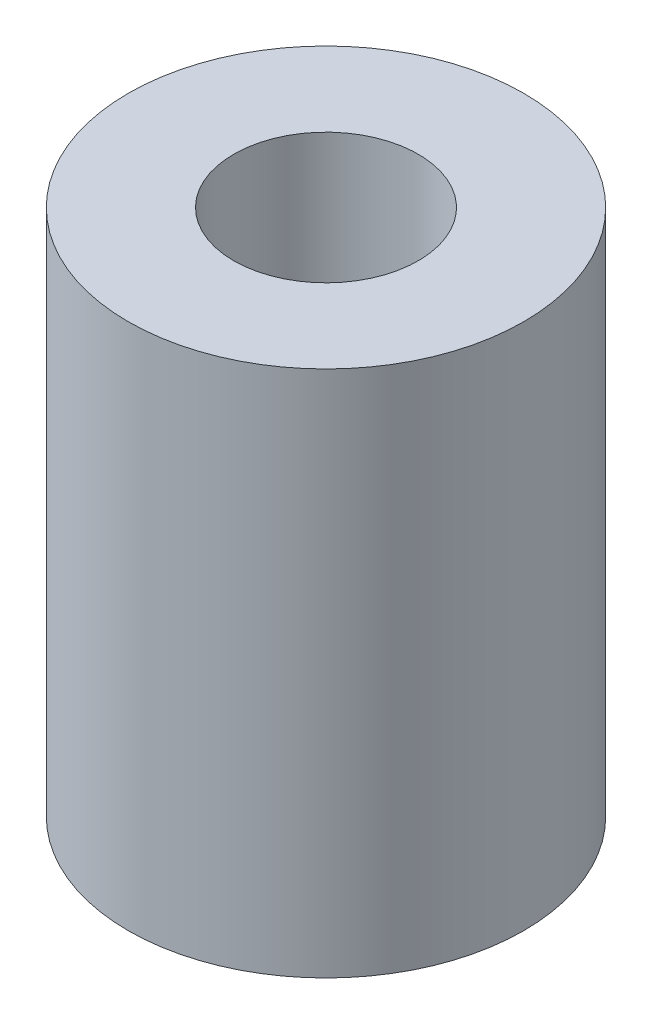
ISO-10303-21;
HEADER;
FILE_DESCRIPTION(('STEP AP214'),'2;1');
FILE_NAME('part.step','',(''),(''),'','','');
FILE_SCHEMA(('AUTOMOTIVE_DESIGN { 1 0 10303 214 1 1 1 1 }'));
ENDSEC;
DATA;
#1=APPLICATION_CONTEXT('core data for automotive mechanical design processes');
#2=APPLICATION_PROTOCOL_DEFINITION('international standard','automotive_design',2000,#1);
#3=PRODUCT_CONTEXT('',#1,'mechanical');
#4=PRODUCT('Part','Part','',(#3));
#5=PRODUCT_RELATED_PRODUCT_CATEGORY('part','',(#4));
#6=PRODUCT_DEFINITION_FORMATION('','',#4);
#7=PRODUCT_DEFINITION_CONTEXT('part definition',#1,'design');
#8=PRODUCT_DEFINITION('design','',#6,#7);
#9=PRODUCT_DEFINITION_SHAPE('','',#8);
#10=(LENGTH_UNIT() NAMED_UNIT(*) SI_UNIT(.MILLI.,.METRE.));
#11=(NAMED_UNIT(*) PLANE_ANGLE_UNIT() SI_UNIT($,.RADIAN.));
#12=(NAMED_UNIT(*) SI_UNIT($,.STERADIAN.) SOLID_ANGLE_UNIT());
#13=UNCERTAINTY_MEASURE_WITH_UNIT(LENGTH_MEASURE(1.E-05),#10,'distance_accuracy_value','');
#14=(GEOMETRIC_REPRESENTATION_CONTEXT(3) GLOBAL_UNCERTAINTY_ASSIGNED_CONTEXT((#13)) GLOBAL_UNIT_ASSIGNED_CONTEXT((#10,
#11,#12)) REPRESENTATION_CONTEXT('',''));
#15=CARTESIAN_POINT('',(0.,0.,0.));
#16=DIRECTION('',(0.,0.,1.));
#17=DIRECTION('',(1.,0.,0.));
#18=AXIS2_PLACEMENT_3D('',#15,#16,#17);
#19=CARTESIAN_POINT('',(0.,10.,0.));
#20=DIRECTION('',(0.,1.,0.));
#21=DIRECTION('',(0.,0.,1.));
#22=AXIS2_PLACEMENT_3D('',#19,#20,#21);
#23=PLANE('',#22);
#24=CARTESIAN_POINT('',(0.,10.,0.));
#25=DIRECTION('',(0.,1.,0.));
#26=DIRECTION('',(0.,0.,1.));
#27=AXIS2_PLACEMENT_3D('',#24,#25,#26);
#28=CIRCLE('',#27,3.75);
#29=CARTESIAN_POINT('',(0.,10.,3.75));
#30=VERTEX_POINT('',#29);
#31=EDGE_CURVE('E10',#30,#30,#28,.T.);
#32=ORIENTED_EDGE('',*,*,#31,.T.);
#33=EDGE_LOOP('',(#32));
#34=FACE_BOUND('',#33,.T.);
#35=CARTESIAN_POINT('',(0.,10.,0.));
#36=DIRECTION('',(0.,1.,0.));
#37=DIRECTION('',(0.,0.,1.));
#38=AXIS2_PLACEMENT_3D('',#35,#36,#37);
#39=CIRCLE('',#38,1.75);
#40=CARTESIAN_POINT('',(0.,10.,1.75));
#41=VERTEX_POINT('',#40);
#42=EDGE_CURVE('E54',#41,#41,#39,.T.);
#43=ORIENTED_EDGE('',*,*,#42,.F.);
#44=EDGE_LOOP('',(#43));
#45=FACE_BOUND('',#44,.T.);
#46=ADVANCED_FACE('F41',(#34,#45),#23,.T.);
#47=CARTESIAN_POINT('',(0.,0.,0.));
#48=DIRECTION('',(0.,1.,0.));
#49=DIRECTION('',(0.,0.,1.));
#50=AXIS2_PLACEMENT_3D('',#47,#48,#49);
#51=PLANE('',#50);
#52=CARTESIAN_POINT('',(0.,0.,0.));
#53=DIRECTION('',(0.,1.,0.));
#54=DIRECTION('',(0.,0.,1.));
#55=AXIS2_PLACEMENT_3D('',#52,#53,#54);
#56=CIRCLE('',#55,3.75);
#57=CARTESIAN_POINT('',(0.,0.,3.75));
#58=VERTEX_POINT('',#57);
#59=EDGE_CURVE('E45',#58,#58,#56,.T.);
#60=ORIENTED_EDGE('',*,*,#59,.F.);
#61=EDGE_LOOP('',(#60));
#62=FACE_BOUND('',#61,.T.);
#63=CARTESIAN_POINT('',(0.,0.,0.));
#64=DIRECTION('',(0.,1.,0.));
#65=DIRECTION('',(0.,0.,1.));
#66=AXIS2_PLACEMENT_3D('',#63,#64,#65);
#67=CIRCLE('',#66,1.75);
#68=CARTESIAN_POINT('',(0.,0.,1.75));
#69=VERTEX_POINT('',#68);
#70=EDGE_CURVE('E56',#69,#69,#67,.T.);
#71=ORIENTED_EDGE('',*,*,#70,.T.);
#72=EDGE_LOOP('',(#71));
#73=FACE_BOUND('',#72,.T.);
#74=ADVANCED_FACE('F68',(#62,#73),#51,.F.);
#75=CARTESIAN_POINT('',(0.,10.,0.));
#76=DIRECTION('',(0.,-1.,0.));
#77=DIRECTION('',(0.,0.,-1.));
#78=AXIS2_PLACEMENT_3D('',#75,#76,#77);
#79=CYLINDRICAL_SURFACE('',#78,3.75);
#80=ORIENTED_EDGE('',*,*,#31,.F.);
#81=EDGE_LOOP('',(#80));
#82=FACE_BOUND('',#81,.T.);
#83=ORIENTED_EDGE('',*,*,#59,.T.);
#84=EDGE_LOOP('',(#83));
#85=FACE_BOUND('',#84,.T.);
#86=ADVANCED_FACE('F43',(#82,#85),#79,.T.);
#87=CARTESIAN_POINT('',(0.,10.,0.));
#88=DIRECTION('',(0.,-1.,0.));
#89=DIRECTION('',(0.,0.,-1.));
#90=AXIS2_PLACEMENT_3D('',#87,#88,#89);
#91=CYLINDRICAL_SURFACE('',#90,1.75);
#92=ORIENTED_EDGE('',*,*,#42,.T.);
#93=EDGE_LOOP('',(#92));
#94=FACE_BOUND('',#93,.T.);
#95=ORIENTED_EDGE('',*,*,#70,.F.);
#96=EDGE_LOOP('',(#95));
#97=FACE_BOUND('',#96,.T.);
#98=ADVANCED_FACE('F64',(#94,#97),#91,.F.);
#99=CLOSED_SHELL('',(#46,#74,#86,#98));
#100=MANIFOLD_SOLID_BREP('B2',#99);
#101=ADVANCED_BREP_SHAPE_REPRESENTATION('',(#18,#100),#14);
#102=SHAPE_DEFINITION_REPRESENTATION(#9,#101);
ENDSEC;
END-ISO-10303-21;
